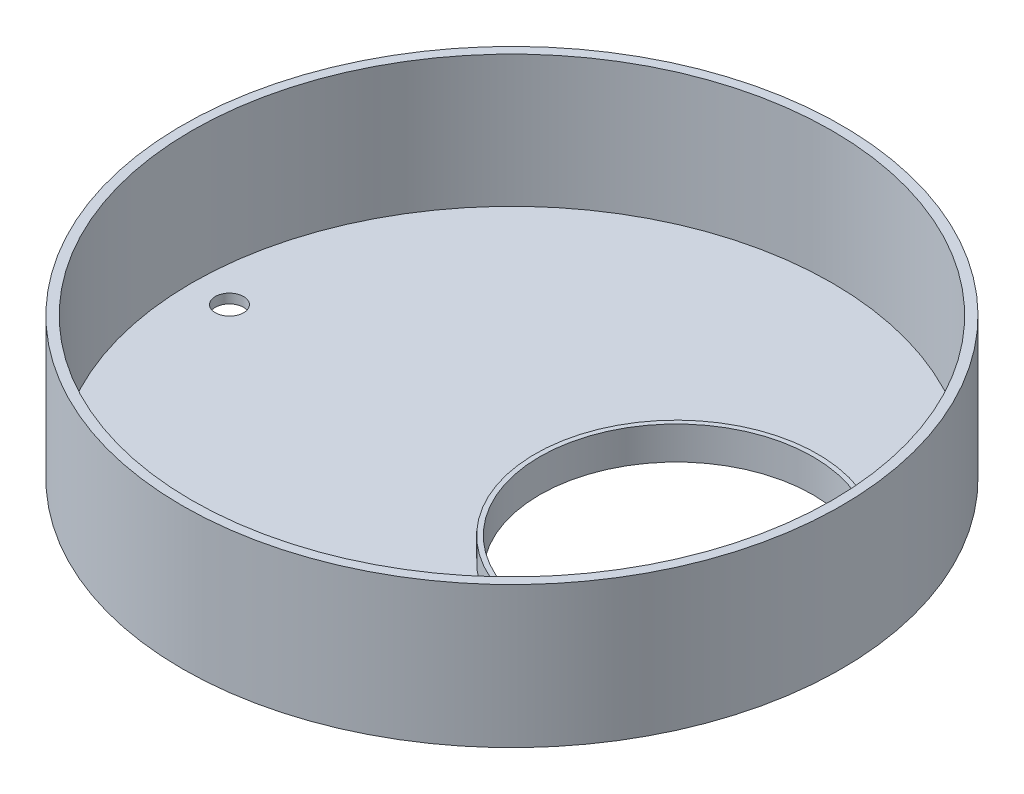
ISO-10303-21;
HEADER;
FILE_DESCRIPTION(('STEP AP214'),'2;1');
FILE_NAME('part.step','',(''),(''),'','','');
FILE_SCHEMA(('AUTOMOTIVE_DESIGN { 1 0 10303 214 1 1 1 1 }'));
ENDSEC;
DATA;
#1=APPLICATION_CONTEXT('core data for automotive mechanical design processes');
#2=APPLICATION_PROTOCOL_DEFINITION('international standard','automotive_design',2000,#1);
#3=PRODUCT_CONTEXT('',#1,'mechanical');
#4=PRODUCT('Part','Part','',(#3));
#5=PRODUCT_RELATED_PRODUCT_CATEGORY('part','',(#4));
#6=PRODUCT_DEFINITION_FORMATION('','',#4);
#7=PRODUCT_DEFINITION_CONTEXT('part definition',#1,'design');
#8=PRODUCT_DEFINITION('design','',#6,#7);
#9=PRODUCT_DEFINITION_SHAPE('','',#8);
#10=(LENGTH_UNIT() NAMED_UNIT(*) SI_UNIT(.MILLI.,.METRE.));
#11=(NAMED_UNIT(*) PLANE_ANGLE_UNIT() SI_UNIT($,.RADIAN.));
#12=(NAMED_UNIT(*) SI_UNIT($,.STERADIAN.) SOLID_ANGLE_UNIT());
#13=UNCERTAINTY_MEASURE_WITH_UNIT(LENGTH_MEASURE(1.E-05),#10,'distance_accuracy_value','');
#14=(GEOMETRIC_REPRESENTATION_CONTEXT(3) GLOBAL_UNCERTAINTY_ASSIGNED_CONTEXT((#13)) GLOBAL_UNIT_ASSIGNED_CONTEXT((#10,
#11,#12)) REPRESENTATION_CONTEXT('',''));
#15=CARTESIAN_POINT('',(0.,0.,0.));
#16=DIRECTION('',(0.,0.,1.));
#17=DIRECTION('',(1.,0.,0.));
#18=AXIS2_PLACEMENT_3D('',#15,#16,#17);
#19=CARTESIAN_POINT('',(0.,30.,0.));
#20=DIRECTION('',(0.,-1.,0.));
#21=DIRECTION('',(0.,0.,-1.));
#22=AXIS2_PLACEMENT_3D('',#19,#20,#21);
#23=CYLINDRICAL_SURFACE('',#22,70.);
#24=CARTESIAN_POINT('',(0.,30.,0.));
#25=DIRECTION('',(0.,1.,0.));
#26=DIRECTION('',(0.,0.,1.));
#27=AXIS2_PLACEMENT_3D('',#24,#25,#26);
#28=CIRCLE('',#27,70.);
#29=CARTESIAN_POINT('',(0.,30.,70.0000000000003));
#30=VERTEX_POINT('',#29);
#31=EDGE_CURVE('E11',#30,#30,#28,.T.);
#32=ORIENTED_EDGE('',*,*,#31,.F.);
#33=EDGE_LOOP('',(#32));
#34=FACE_BOUND('',#33,.T.);
#35=CARTESIAN_POINT('',(0.,0.,0.));
#36=DIRECTION('',(0.,1.,0.));
#37=DIRECTION('',(0.,0.,1.));
#38=AXIS2_PLACEMENT_3D('',#35,#36,#37);
#39=CIRCLE('',#38,70.);
#40=CARTESIAN_POINT('',(0.,0.,70.0000000000003));
#41=VERTEX_POINT('',#40);
#42=EDGE_CURVE('E52',#41,#41,#39,.T.);
#43=ORIENTED_EDGE('',*,*,#42,.T.);
#44=EDGE_LOOP('',(#43));
#45=FACE_BOUND('',#44,.T.);
#46=ADVANCED_FACE('F44',(#34,#45),#23,.T.);
#47=CARTESIAN_POINT('',(0.,30.,0.));
#48=DIRECTION('',(0.,1.,0.));
#49=DIRECTION('',(0.,0.,1.));
#50=AXIS2_PLACEMENT_3D('',#47,#48,#49);
#51=PLANE('',#50);
#52=CARTESIAN_POINT('',(0.,30.,0.));
#53=DIRECTION('',(0.,1.,0.));
#54=DIRECTION('',(0.,0.,1.));
#55=AXIS2_PLACEMENT_3D('',#52,#53,#54);
#56=CIRCLE('',#55,68.);
#57=CARTESIAN_POINT('',(0.,30.,68.0000000000003));
#58=VERTEX_POINT('',#57);
#59=EDGE_CURVE('E59',#58,#58,#56,.T.);
#60=ORIENTED_EDGE('',*,*,#59,.F.);
#61=EDGE_LOOP('',(#60));
#62=FACE_BOUND('',#61,.T.);
#63=ORIENTED_EDGE('',*,*,#31,.T.);
#64=EDGE_LOOP('',(#63));
#65=FACE_BOUND('',#64,.T.);
#66=ADVANCED_FACE('F128',(#62,#65),#51,.T.);
#67=CARTESIAN_POINT('',(0.,0.,0.));
#68=DIRECTION('',(0.,1.,0.));
#69=DIRECTION('',(0.,0.,1.));
#70=AXIS2_PLACEMENT_3D('',#67,#68,#69);
#71=PLANE('',#70);
#72=CARTESIAN_POINT('',(-60.0000000000002,0.,0.));
#73=DIRECTION('',(0.,1.,0.));
#74=DIRECTION('',(0.,0.,1.));
#75=AXIS2_PLACEMENT_3D('',#72,#73,#74);
#76=CIRCLE('',#75,3.);
#77=CARTESIAN_POINT('',(-60.0000000000002,0.,3.00000000000001));
#78=VERTEX_POINT('',#77);
#79=EDGE_CURVE('E84',#78,#78,#76,.T.);
#80=ORIENTED_EDGE('',*,*,#79,.T.);
#81=EDGE_LOOP('',(#80));
#82=FACE_BOUND('',#81,.T.);
#83=CARTESIAN_POINT('',(34.9213126760467,0.,0.));
#84=DIRECTION('',(0.,1.,0.));
#85=DIRECTION('',(0.,0.,1.));
#86=AXIS2_PLACEMENT_3D('',#83,#84,#85);
#87=CIRCLE('',#86,29.);
#88=CARTESIAN_POINT('',(34.9213126760467,0.,29.0000000000001));
#89=VERTEX_POINT('',#88);
#90=EDGE_CURVE('E77',#89,#89,#87,.T.);
#91=ORIENTED_EDGE('',*,*,#90,.T.);
#92=EDGE_LOOP('',(#91));
#93=FACE_BOUND('',#92,.T.);
#94=ORIENTED_EDGE('',*,*,#42,.F.);
#95=EDGE_LOOP('',(#94));
#96=FACE_BOUND('',#95,.T.);
#97=ADVANCED_FACE('F133',(#82,#93,#96),#71,.F.);
#98=CARTESIAN_POINT('',(0.,30.,0.));
#99=DIRECTION('',(0.,-1.,0.));
#100=DIRECTION('',(0.,0.,-1.));
#101=AXIS2_PLACEMENT_3D('',#98,#99,#100);
#102=CYLINDRICAL_SURFACE('',#101,68.);
#103=ORIENTED_EDGE('',*,*,#59,.T.);
#104=EDGE_LOOP('',(#103));
#105=FACE_BOUND('',#104,.T.);
#106=CARTESIAN_POINT('',(0.,2.,0.));
#107=DIRECTION('',(0.,1.,0.));
#108=DIRECTION('',(0.,0.,1.));
#109=AXIS2_PLACEMENT_3D('',#106,#107,#108);
#110=CIRCLE('',#109,68.);
#111=CARTESIAN_POINT('',(0.,2.,68.0000000000003));
#112=VERTEX_POINT('',#111);
#113=EDGE_CURVE('E64',#112,#112,#110,.T.);
#114=ORIENTED_EDGE('',*,*,#113,.F.);
#115=EDGE_LOOP('',(#114));
#116=FACE_BOUND('',#115,.T.);
#117=ADVANCED_FACE('F102',(#105,#116),#102,.F.);
#118=CARTESIAN_POINT('',(0.,2.,0.));
#119=DIRECTION('',(0.,1.,0.));
#120=DIRECTION('',(0.,0.,1.));
#121=AXIS2_PLACEMENT_3D('',#118,#119,#120);
#122=PLANE('',#121);
#123=CARTESIAN_POINT('',(-60.0000000000002,2.,0.));
#124=DIRECTION('',(0.,1.,0.));
#125=DIRECTION('',(0.,0.,1.));
#126=AXIS2_PLACEMENT_3D('',#123,#124,#125);
#127=CIRCLE('',#126,3.);
#128=CARTESIAN_POINT('',(-60.0000000000002,2.,3.00000000000001));
#129=VERTEX_POINT('',#128);
#130=EDGE_CURVE('E47',#129,#129,#127,.T.);
#131=ORIENTED_EDGE('',*,*,#130,.F.);
#132=EDGE_LOOP('',(#131));
#133=FACE_BOUND('',#132,.T.);
#134=ORIENTED_EDGE('',*,*,#113,.T.);
#135=EDGE_LOOP('',(#134));
#136=FACE_BOUND('',#135,.T.);
#137=CARTESIAN_POINT('',(34.9213126760467,1.99999999999997,0.));
#138=DIRECTION('',(0.,1.,0.));
#139=DIRECTION('',(0.,0.,1.));
#140=AXIS2_PLACEMENT_3D('',#137,#138,#139);
#141=CIRCLE('',#140,30.);
#142=CARTESIAN_POINT('',(34.9213126760467,1.99999999999997,30.0000000000001));
#143=VERTEX_POINT('',#142);
#144=EDGE_CURVE('E72',#143,#143,#141,.T.);
#145=ORIENTED_EDGE('',*,*,#144,.F.);
#146=EDGE_LOOP('',(#145));
#147=FACE_BOUND('',#146,.T.);
#148=ADVANCED_FACE('F98',(#133,#136,#147),#122,.T.);
#149=CARTESIAN_POINT('',(34.9213126760467,1.99999999999997,0.));
#150=DIRECTION('',(0.,1.,0.));
#151=DIRECTION('',(0.,0.,1.));
#152=AXIS2_PLACEMENT_3D('',#149,#150,#151);
#153=CYLINDRICAL_SURFACE('',#152,30.);
#154=ORIENTED_EDGE('',*,*,#144,.T.);
#155=EDGE_LOOP('',(#154));
#156=FACE_BOUND('',#155,.T.);
#157=CARTESIAN_POINT('',(34.9213126760467,7.00000000000001,0.));
#158=DIRECTION('',(0.,1.,0.));
#159=DIRECTION('',(0.,0.,1.));
#160=AXIS2_PLACEMENT_3D('',#157,#158,#159);
#161=CIRCLE('',#160,30.);
#162=CARTESIAN_POINT('',(34.9213126760467,7.00000000000001,30.0000000000001));
#163=VERTEX_POINT('',#162);
#164=EDGE_CURVE('E73',#163,#163,#161,.T.);
#165=ORIENTED_EDGE('',*,*,#164,.F.);
#166=EDGE_LOOP('',(#165));
#167=FACE_BOUND('',#166,.T.);
#168=ADVANCED_FACE('F101',(#156,#167),#153,.T.);
#169=CARTESIAN_POINT('',(34.9213126760467,7.00000000000001,0.));
#170=DIRECTION('',(0.,-1.,0.));
#171=DIRECTION('',(0.,0.,-1.));
#172=AXIS2_PLACEMENT_3D('',#169,#170,#171);
#173=CYLINDRICAL_SURFACE('',#172,29.);
#174=CARTESIAN_POINT('',(34.9213126760467,7.00000000000001,0.));
#175=DIRECTION('',(0.,1.,0.));
#176=DIRECTION('',(0.,0.,1.));
#177=AXIS2_PLACEMENT_3D('',#174,#175,#176);
#178=CIRCLE('',#177,29.);
#179=CARTESIAN_POINT('',(34.9213126760467,7.00000000000001,29.0000000000001));
#180=VERTEX_POINT('',#179);
#181=EDGE_CURVE('E68',#180,#180,#178,.T.);
#182=ORIENTED_EDGE('',*,*,#181,.T.);
#183=EDGE_LOOP('',(#182));
#184=FACE_BOUND('',#183,.T.);
#185=ORIENTED_EDGE('',*,*,#90,.F.);
#186=EDGE_LOOP('',(#185));
#187=FACE_BOUND('',#186,.T.);
#188=ADVANCED_FACE('F110',(#184,#187),#173,.F.);
#189=CARTESIAN_POINT('',(34.9213126760467,7.00000000000001,0.));
#190=DIRECTION('',(0.,1.,0.));
#191=DIRECTION('',(0.,0.,1.));
#192=AXIS2_PLACEMENT_3D('',#189,#190,#191);
#193=PLANE('',#192);
#194=ORIENTED_EDGE('',*,*,#181,.F.);
#195=EDGE_LOOP('',(#194));
#196=FACE_BOUND('',#195,.T.);
#197=ORIENTED_EDGE('',*,*,#164,.T.);
#198=EDGE_LOOP('',(#197));
#199=FACE_BOUND('',#198,.T.);
#200=ADVANCED_FACE('F114',(#196,#199),#193,.T.);
#201=CARTESIAN_POINT('',(-60.0000000000002,-3.,0.));
#202=DIRECTION('',(0.,1.,0.));
#203=DIRECTION('',(0.,0.,1.));
#204=AXIS2_PLACEMENT_3D('',#201,#202,#203);
#205=CYLINDRICAL_SURFACE('',#204,3.);
#206=ORIENTED_EDGE('',*,*,#130,.T.);
#207=EDGE_LOOP('',(#206));
#208=FACE_BOUND('',#207,.T.);
#209=ORIENTED_EDGE('',*,*,#79,.F.);
#210=EDGE_LOOP('',(#209));
#211=FACE_BOUND('',#210,.T.);
#212=ADVANCED_FACE('F95',(#208,#211),#205,.F.);
#213=CLOSED_SHELL('',(#46,#66,#97,#117,#148,#168,#188,#200,#212));
#214=MANIFOLD_SOLID_BREP('B2',#213);
#215=ADVANCED_BREP_SHAPE_REPRESENTATION('',(#18,#214),#14);
#216=SHAPE_DEFINITION_REPRESENTATION(#9,#215);
ENDSEC;
END-ISO-10303-21;
